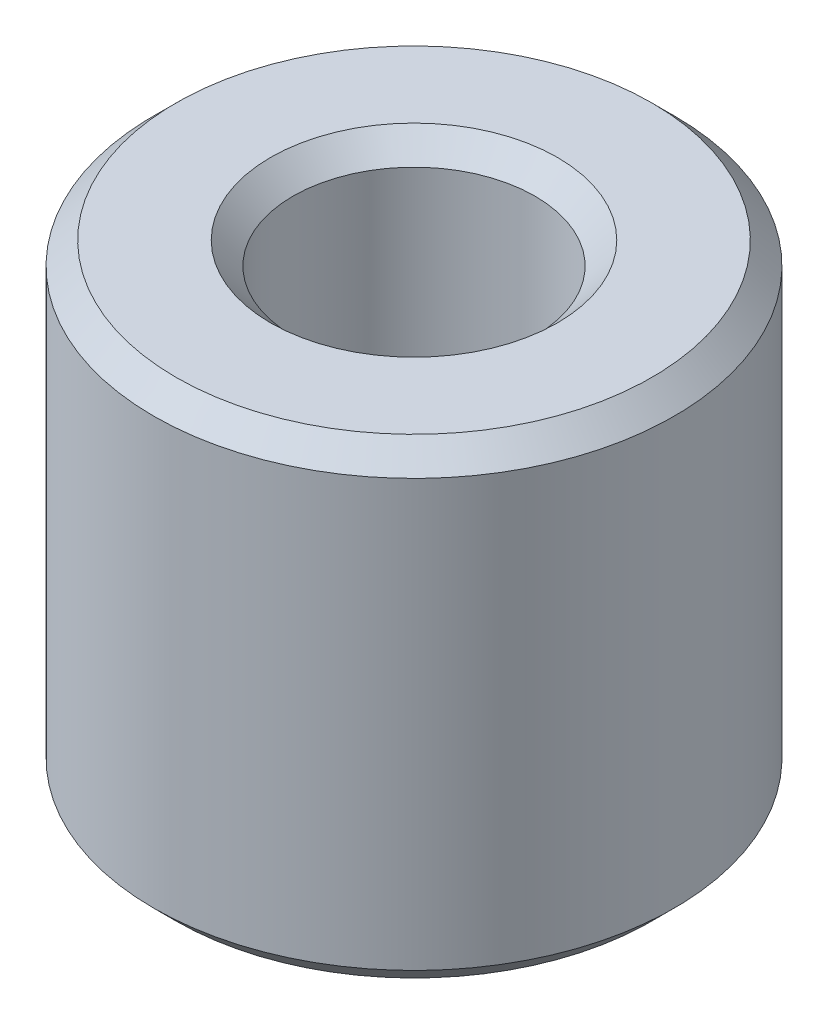
ISO-10303-21;
HEADER;
FILE_DESCRIPTION(('STEP AP214'),'2;1');
FILE_NAME('part.step','',(''),(''),'','','');
FILE_SCHEMA(('AUTOMOTIVE_DESIGN { 1 0 10303 214 1 1 1 1 }'));
ENDSEC;
DATA;
#1=APPLICATION_CONTEXT('core data for automotive mechanical design processes');
#2=APPLICATION_PROTOCOL_DEFINITION('international standard','automotive_design',2000,#1);
#3=PRODUCT_CONTEXT('',#1,'mechanical');
#4=PRODUCT('Part','Part','',(#3));
#5=PRODUCT_RELATED_PRODUCT_CATEGORY('part','',(#4));
#6=PRODUCT_DEFINITION_FORMATION('','',#4);
#7=PRODUCT_DEFINITION_CONTEXT('part definition',#1,'design');
#8=PRODUCT_DEFINITION('design','',#6,#7);
#9=PRODUCT_DEFINITION_SHAPE('','',#8);
#10=(LENGTH_UNIT() NAMED_UNIT(*) SI_UNIT(.MILLI.,.METRE.));
#11=(NAMED_UNIT(*) PLANE_ANGLE_UNIT() SI_UNIT($,.RADIAN.));
#12=(NAMED_UNIT(*) SI_UNIT($,.STERADIAN.) SOLID_ANGLE_UNIT());
#13=UNCERTAINTY_MEASURE_WITH_UNIT(LENGTH_MEASURE(1.E-05),#10,'distance_accuracy_value','');
#14=(GEOMETRIC_REPRESENTATION_CONTEXT(3) GLOBAL_UNCERTAINTY_ASSIGNED_CONTEXT((#13)) GLOBAL_UNIT_ASSIGNED_CONTEXT((#10,
#11,#12)) REPRESENTATION_CONTEXT('',''));
#15=CARTESIAN_POINT('',(0.,0.,0.));
#16=DIRECTION('',(0.,0.,1.));
#17=DIRECTION('',(1.,0.,0.));
#18=AXIS2_PLACEMENT_3D('',#15,#16,#17);
#19=CARTESIAN_POINT('',(0.,81.4323503337985,0.));
#20=DIRECTION('',(0.,-1.,0.));
#21=DIRECTION('',(0.,0.,-1.));
#22=AXIS2_PLACEMENT_3D('',#19,#20,#21);
#23=CYLINDRICAL_SURFACE('',#22,45.);
#24=CARTESIAN_POINT('',(0.,3.86876396391972,0.));
#25=DIRECTION('',(0.,1.,0.));
#26=DIRECTION('',(0.,0.,1.));
#27=AXIS2_PLACEMENT_3D('',#24,#25,#26);
#28=CIRCLE('',#27,45.);
#29=CARTESIAN_POINT('',(0.,3.86876396391972,45.));
#30=VERTEX_POINT('',#29);
#31=EDGE_CURVE('E10',#30,#30,#28,.T.);
#32=ORIENTED_EDGE('',*,*,#31,.T.);
#33=EDGE_LOOP('',(#32));
#34=FACE_BOUND('',#33,.T.);
#35=CARTESIAN_POINT('',(0.,77.5635863698787,0.));
#36=DIRECTION('',(0.,1.,0.));
#37=DIRECTION('',(0.,0.,1.));
#38=AXIS2_PLACEMENT_3D('',#35,#36,#37);
#39=CIRCLE('',#38,45.);
#40=CARTESIAN_POINT('',(0.,77.5635863698787,45.));
#41=VERTEX_POINT('',#40);
#42=EDGE_CURVE('E50',#41,#41,#39,.F.);
#43=ORIENTED_EDGE('',*,*,#42,.T.);
#44=EDGE_LOOP('',(#43));
#45=FACE_BOUND('',#44,.T.);
#46=ADVANCED_FACE('F39',(#34,#45),#23,.T.);
#47=CARTESIAN_POINT('',(0.,81.4323503337985,0.));
#48=DIRECTION('',(0.,1.,0.));
#49=DIRECTION('',(0.,0.,1.));
#50=AXIS2_PLACEMENT_3D('',#47,#48,#49);
#51=PLANE('',#50);
#52=CARTESIAN_POINT('',(0.,81.4323503337985,0.));
#53=DIRECTION('',(0.,1.,0.));
#54=DIRECTION('',(0.,0.,1.));
#55=AXIS2_PLACEMENT_3D('',#52,#53,#54);
#56=CIRCLE('',#55,24.798849903263);
#57=CARTESIAN_POINT('',(0.,81.4323503337985,24.798849903263));
#58=VERTEX_POINT('',#57);
#59=EDGE_CURVE('E58',#58,#58,#56,.F.);
#60=ORIENTED_EDGE('',*,*,#59,.T.);
#61=EDGE_LOOP('',(#60));
#62=FACE_BOUND('',#61,.T.);
#63=CARTESIAN_POINT('',(0.,81.4323503337985,0.));
#64=DIRECTION('',(0.,1.,0.));
#65=DIRECTION('',(0.,0.,1.));
#66=AXIS2_PLACEMENT_3D('',#63,#64,#65);
#67=CIRCLE('',#66,41.1312360360803);
#68=CARTESIAN_POINT('',(0.,81.4323503337985,41.1312360360803));
#69=VERTEX_POINT('',#68);
#70=EDGE_CURVE('E61',#69,#69,#67,.T.);
#71=ORIENTED_EDGE('',*,*,#70,.T.);
#72=EDGE_LOOP('',(#71));
#73=FACE_BOUND('',#72,.T.);
#74=ADVANCED_FACE('F88',(#62,#73),#51,.T.);
#75=CARTESIAN_POINT('',(0.,0.,0.));
#76=DIRECTION('',(0.,1.,0.));
#77=DIRECTION('',(0.,0.,1.));
#78=AXIS2_PLACEMENT_3D('',#75,#76,#77);
#79=PLANE('',#78);
#80=CARTESIAN_POINT('',(0.,0.,0.));
#81=DIRECTION('',(0.,1.,0.));
#82=DIRECTION('',(0.,0.,1.));
#83=AXIS2_PLACEMENT_3D('',#80,#81,#82);
#84=CIRCLE('',#83,24.7988499032629);
#85=CARTESIAN_POINT('',(0.,0.,-24.7988499032629));
#86=VERTEX_POINT('',#85);
#87=EDGE_CURVE('E51',#86,#86,#84,.T.);
#88=ORIENTED_EDGE('',*,*,#87,.T.);
#89=EDGE_LOOP('',(#88));
#90=FACE_BOUND('',#89,.T.);
#91=CARTESIAN_POINT('',(0.,0.,0.));
#92=DIRECTION('',(0.,1.,0.));
#93=DIRECTION('',(0.,0.,1.));
#94=AXIS2_PLACEMENT_3D('',#91,#92,#93);
#95=CIRCLE('',#94,41.1312360360802);
#96=CARTESIAN_POINT('',(0.,0.,41.1312360360802));
#97=VERTEX_POINT('',#96);
#98=EDGE_CURVE('E54',#97,#97,#95,.F.);
#99=ORIENTED_EDGE('',*,*,#98,.T.);
#100=EDGE_LOOP('',(#99));
#101=FACE_BOUND('',#100,.T.);
#102=ADVANCED_FACE('F83',(#90,#101),#79,.F.);
#103=CARTESIAN_POINT('',(0.,81.4323503337985,0.));
#104=DIRECTION('',(0.,-1.,0.));
#105=DIRECTION('',(0.,0.,-1.));
#106=AXIS2_PLACEMENT_3D('',#103,#104,#105);
#107=CYLINDRICAL_SURFACE('',#106,20.9300859393432);
#108=CARTESIAN_POINT('',(0.,77.5635863698788,0.));
#109=DIRECTION('',(0.,1.,0.));
#110=DIRECTION('',(0.,0.,1.));
#111=AXIS2_PLACEMENT_3D('',#108,#109,#110);
#112=CIRCLE('',#111,20.9300859393432);
#113=CARTESIAN_POINT('',(0.,77.5635863698788,20.9300859393432));
#114=VERTEX_POINT('',#113);
#115=EDGE_CURVE('E67',#114,#114,#112,.T.);
#116=ORIENTED_EDGE('',*,*,#115,.T.);
#117=EDGE_LOOP('',(#116));
#118=FACE_BOUND('',#117,.T.);
#119=CARTESIAN_POINT('',(0.,3.86876396391973,0.));
#120=DIRECTION('',(0.,1.,0.));
#121=DIRECTION('',(0.,0.,1.));
#122=AXIS2_PLACEMENT_3D('',#119,#120,#121);
#123=CIRCLE('',#122,20.9300859393432);
#124=CARTESIAN_POINT('',(0.,3.86876396391973,-20.9300859393432));
#125=VERTEX_POINT('',#124);
#126=EDGE_CURVE('E69',#125,#125,#123,.F.);
#127=ORIENTED_EDGE('',*,*,#126,.T.);
#128=EDGE_LOOP('',(#127));
#129=FACE_BOUND('',#128,.T.);
#130=ADVANCED_FACE('F71',(#118,#129),#107,.F.);
#131=CARTESIAN_POINT('',(0.,77.5635863698788,0.));
#132=DIRECTION('',(0.,1.,0.));
#133=DIRECTION('',(0.,0.,1.));
#134=AXIS2_PLACEMENT_3D('',#131,#132,#133);
#135=CONICAL_SURFACE('',#134,20.9300859393432,0.78539816339745);
#136=ORIENTED_EDGE('',*,*,#59,.F.);
#137=EDGE_LOOP('',(#136));
#138=FACE_BOUND('',#137,.T.);
#139=ORIENTED_EDGE('',*,*,#115,.F.);
#140=EDGE_LOOP('',(#139));
#141=FACE_BOUND('',#140,.T.);
#142=ADVANCED_FACE('F77',(#138,#141),#135,.F.);
#143=CARTESIAN_POINT('',(0.,0.,0.));
#144=DIRECTION('',(0.,-1.,0.));
#145=DIRECTION('',(0.,0.,-1.));
#146=AXIS2_PLACEMENT_3D('',#143,#144,#145);
#147=CONICAL_SURFACE('',#146,24.7988499032629,0.785398163397444);
#148=CARTESIAN_POINT('',(0.,3.86876396391973,-20.9300859393432));
#149=CARTESIAN_POINT('',(0.,3.82846433929557,-20.9703855639674));
#150=CARTESIAN_POINT('',(0.,3.78816471467141,-21.0106851885916));
#151=CARTESIAN_POINT('',(0.,3.70756546542308,-21.0912844378399));
#152=CARTESIAN_POINT('',(0.,3.66726584079891,-21.1315840624641));
#153=CARTESIAN_POINT('',(0.,3.58666659155059,-21.2121833117124));
#154=CARTESIAN_POINT('',(0.,3.54636696692642,-21.2524829363366));
#155=CARTESIAN_POINT('',(0.,3.46576771767809,-21.3330821855849));
#156=CARTESIAN_POINT('',(0.,3.42546809305393,-21.373381810209));
#157=CARTESIAN_POINT('',(0.,3.3448688438056,-21.4539810594574));
#158=CARTESIAN_POINT('',(0.,3.30456921918144,-21.4942806840815));
#159=CARTESIAN_POINT('',(0.,3.22396996993311,-21.5748799333299));
#160=CARTESIAN_POINT('',(0.,3.18367034530895,-21.615179557954));
#161=CARTESIAN_POINT('',(0.,3.10307109606062,-21.6957788072024));
#162=CARTESIAN_POINT('',(0.,3.06277147143646,-21.7360784318265));
#163=CARTESIAN_POINT('',(0.,2.98217222218813,-21.8166776810748));
#164=CARTESIAN_POINT('',(0.,2.94187259756396,-21.856977305699));
#165=CARTESIAN_POINT('',(0.,2.86127334831564,-21.9375765549473));
#166=CARTESIAN_POINT('',(0.,2.82097372369147,-21.9778761795715));
#167=CARTESIAN_POINT('',(0.,2.74037447444314,-22.0584754288198));
#168=CARTESIAN_POINT('',(0.,2.70007484981898,-22.098775053444));
#169=CARTESIAN_POINT('',(0.,2.61947560057065,-22.1793743026923));
#170=CARTESIAN_POINT('',(0.,2.57917597594649,-22.2196739273165));
#171=CARTESIAN_POINT('',(0.,2.49857672669816,-22.3002731765648));
#172=CARTESIAN_POINT('',(0.,2.458277102074,-22.340572801189));
#173=CARTESIAN_POINT('',(0.,2.37767785282567,-22.4211720504373));
#174=CARTESIAN_POINT('',(0.,2.3373782282015,-22.4614716750615));
#175=CARTESIAN_POINT('',(0.,2.25677897895318,-22.5420709243098));
#176=CARTESIAN_POINT('',(0.,2.21647935432901,-22.582370548934));
#177=CARTESIAN_POINT('',(0.,2.13588010508069,-22.6629697981823));
#178=CARTESIAN_POINT('',(0.,2.09558048045652,-22.7032694228064));
#179=CARTESIAN_POINT('',(0.,2.01498123120819,-22.7838686720548));
#180=CARTESIAN_POINT('',(0.,1.97468160658403,-22.8241682966789));
#181=CARTESIAN_POINT('',(0.,1.8940823573357,-22.9047675459273));
#182=CARTESIAN_POINT('',(0.,1.85378273271154,-22.9450671705514));
#183=CARTESIAN_POINT('',(0.,1.77318348346321,-23.0256664197998));
#184=CARTESIAN_POINT('',(0.,1.73288385883905,-23.0659660444239));
#185=CARTESIAN_POINT('',(0.,1.65228460959072,-23.1465652936722));
#186=CARTESIAN_POINT('',(0.,1.61198498496656,-23.1868649182964));
#187=CARTESIAN_POINT('',(0.,1.53138573571823,-23.2674641675447));
#188=CARTESIAN_POINT('',(0.,1.49108611109406,-23.3077637921689));
#189=CARTESIAN_POINT('',(0.,1.41048686184574,-23.3883630414172));
#190=CARTESIAN_POINT('',(0.,1.37018723722157,-23.4286626660414));
#191=CARTESIAN_POINT('',(0.,1.28958798797324,-23.5092619152897));
#192=CARTESIAN_POINT('',(0.,1.24928836334908,-23.5495615399139));
#193=CARTESIAN_POINT('',(0.,1.16868911410075,-23.6301607891622));
#194=CARTESIAN_POINT('',(0.,1.12838948947659,-23.6704604137864));
#195=CARTESIAN_POINT('',(0.,1.04779024022826,-23.7510596630347));
#196=CARTESIAN_POINT('',(0.,1.0074906156041,-23.7913592876589));
#197=CARTESIAN_POINT('',(0.,0.926891366355769,-23.8719585369072));
#198=CARTESIAN_POINT('',(0.,0.886591741731606,-23.9122581615313));
#199=CARTESIAN_POINT('',(0.,0.805992492483278,-23.9928574107797));
#200=CARTESIAN_POINT('',(0.,0.765692867859114,-24.0331570354038));
#201=CARTESIAN_POINT('',(0.,0.685093618610786,-24.1137562846522));
#202=CARTESIAN_POINT('',(0.,0.644793993986622,-24.1540559092763));
#203=CARTESIAN_POINT('',(0.,0.564194744738294,-24.2346551585247));
#204=CARTESIAN_POINT('',(0.,0.523895120114131,-24.2749547831488));
#205=CARTESIAN_POINT('',(0.,0.443295870865803,-24.3555540323971));
#206=CARTESIAN_POINT('',(0.,0.402996246241639,-24.3958536570213));
#207=CARTESIAN_POINT('',(0.,0.322396996993311,-24.4764529062696));
#208=CARTESIAN_POINT('',(0.,0.282097372369147,-24.5167525308938));
#209=CARTESIAN_POINT('',(0.,0.201498123120819,-24.5973517801421));
#210=CARTESIAN_POINT('',(0.,0.161198498496656,-24.6376514047663));
#211=CARTESIAN_POINT('',(0.,0.0805992492483283,-24.7182506540146));
#212=CARTESIAN_POINT('',(0.,0.0402996246241646,-24.7585502786388));
#213=CARTESIAN_POINT('',(0.,0.,-24.7988499032629));
#214=B_SPLINE_CURVE_WITH_KNOTS('',3,(#148,#149,#150,#151,#152,#153,#154,#155,#156,#157,#158,
#159,#160,#161,#162,#163,#164,#165,#166,#167,#168,#169,#170,#171,#172,#173,#174,#175,#176,#177,
#178,#179,#180,#181,#182,#183,#184,#185,#186,#187,#188,#189,#190,#191,#192,#193,#194,#195,#196,
#197,#198,#199,#200,#201,#202,#203,#204,#205,#206,#207,#208,#209,#210,#211,#212,#213),
.UNSPECIFIED.,.F.,.F.,(4,2,2,2,2,2,2,2,2,2,2,2,2,2,2,2,2,2,2,2,2,2,2,2,2,2,2,2,2,2,2,2,4),(0.,
0.170976827106113,0.341953654212223,0.512930481318334,0.683907308424444,0.854884135530557,
1.02586096263667,1.19683778974278,1.36781461684889,1.538791443955,1.70976827106111,
1.88074509816722,2.05172192527333,2.22269875237945,2.39367557948556,2.56465240659167,
2.73562923369778,2.90660606080389,3.07758288791,3.24855971501611,3.41953654212222,
3.59051336922834,3.76149019633445,3.93246702344056,4.10344385054667,4.27442067765278,
4.44539750475889,4.616374331865,4.78735115897112,4.95832798607723,5.12930481318334,
5.30028164028945,5.47125846739556),.UNSPECIFIED.);
#215=EDGE_CURVE('BSEAM73',#125,#86,#214,.T.);
#216=ORIENTED_EDGE('',*,*,#126,.F.);
#217=ORIENTED_EDGE('',*,*,#87,.F.);
#218=ORIENTED_EDGE('',*,*,#215,.T.);
#219=ORIENTED_EDGE('',*,*,#215,.F.);
#220=EDGE_LOOP('',(#216,#218,#217,#219));
#221=FACE_BOUND('',#220,.T.);
#222=ADVANCED_FACE('F73',(#221),#147,.F.);
#223=CARTESIAN_POINT('',(0.,3.86876396391972,0.));
#224=DIRECTION('',(0.,1.,0.));
#225=DIRECTION('',(0.,0.,1.));
#226=AXIS2_PLACEMENT_3D('',#223,#224,#225);
#227=CONICAL_SURFACE('',#226,45.,0.785398163397454);
#228=ORIENTED_EDGE('',*,*,#98,.F.);
#229=EDGE_LOOP('',(#228));
#230=FACE_BOUND('',#229,.T.);
#231=ORIENTED_EDGE('',*,*,#31,.F.);
#232=EDGE_LOOP('',(#231));
#233=FACE_BOUND('',#232,.T.);
#234=ADVANCED_FACE('F76',(#230,#233),#227,.T.);
#235=CARTESIAN_POINT('',(0.,81.4323503337985,0.));
#236=DIRECTION('',(0.,-1.,0.));
#237=DIRECTION('',(0.,0.,-1.));
#238=AXIS2_PLACEMENT_3D('',#235,#236,#237);
#239=CONICAL_SURFACE('',#238,41.1312360360803,0.785398163397442);
#240=ORIENTED_EDGE('',*,*,#42,.F.);
#241=EDGE_LOOP('',(#240));
#242=FACE_BOUND('',#241,.T.);
#243=ORIENTED_EDGE('',*,*,#70,.F.);
#244=EDGE_LOOP('',(#243));
#245=FACE_BOUND('',#244,.T.);
#246=ADVANCED_FACE('F45',(#242,#245),#239,.T.);
#247=CLOSED_SHELL('',(#46,#74,#102,#130,#142,#222,#234,#246));
#248=MANIFOLD_SOLID_BREP('B2',#247);
#249=ADVANCED_BREP_SHAPE_REPRESENTATION('',(#18,#248),#14);
#250=SHAPE_DEFINITION_REPRESENTATION(#9,#249);
ENDSEC;
END-ISO-10303-21;
